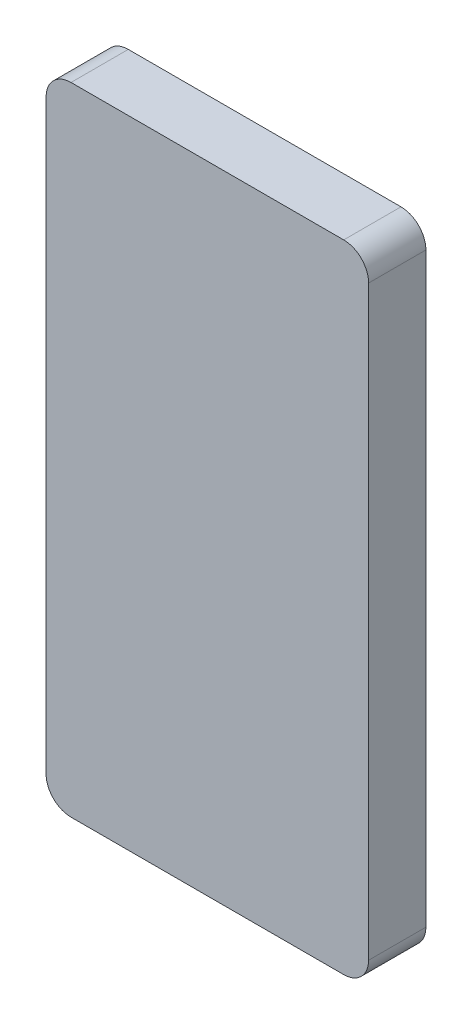
ISO-10303-21;
HEADER;
FILE_DESCRIPTION(('STEP AP214'),'2;1');
FILE_NAME('part.step','',(''),(''),'','','');
FILE_SCHEMA(('AUTOMOTIVE_DESIGN { 1 0 10303 214 1 1 1 1 }'));
ENDSEC;
DATA;
#1=APPLICATION_CONTEXT('core data for automotive mechanical design processes');
#2=APPLICATION_PROTOCOL_DEFINITION('international standard','automotive_design',2000,#1);
#3=PRODUCT_CONTEXT('',#1,'mechanical');
#4=PRODUCT('Part','Part','',(#3));
#5=PRODUCT_RELATED_PRODUCT_CATEGORY('part','',(#4));
#6=PRODUCT_DEFINITION_FORMATION('','',#4);
#7=PRODUCT_DEFINITION_CONTEXT('part definition',#1,'design');
#8=PRODUCT_DEFINITION('design','',#6,#7);
#9=PRODUCT_DEFINITION_SHAPE('','',#8);
#10=(LENGTH_UNIT() NAMED_UNIT(*) SI_UNIT(.MILLI.,.METRE.));
#11=(NAMED_UNIT(*) PLANE_ANGLE_UNIT() SI_UNIT($,.RADIAN.));
#12=(NAMED_UNIT(*) SI_UNIT($,.STERADIAN.) SOLID_ANGLE_UNIT());
#13=UNCERTAINTY_MEASURE_WITH_UNIT(LENGTH_MEASURE(1.E-05),#10,'distance_accuracy_value','');
#14=(GEOMETRIC_REPRESENTATION_CONTEXT(3) GLOBAL_UNCERTAINTY_ASSIGNED_CONTEXT((#13)) GLOBAL_UNIT_ASSIGNED_CONTEXT((#10,
#11,#12)) REPRESENTATION_CONTEXT('',''));
#15=CARTESIAN_POINT('',(0.,0.,0.));
#16=DIRECTION('',(0.,0.,1.));
#17=DIRECTION('',(1.,0.,0.));
#18=AXIS2_PLACEMENT_3D('',#15,#16,#17);
#19=CARTESIAN_POINT('',(32.893,-64.897,11.684));
#20=DIRECTION('',(-1.,0.,0.));
#21=DIRECTION('',(0.,0.,1.));
#22=AXIS2_PLACEMENT_3D('',#19,#20,#21);
#23=PLANE('',#22);
#24=DIRECTION('',(0.,1.,0.));
#25=VECTOR('',#24,1.);
#26=CARTESIAN_POINT('',(32.893,-64.897,11.684));
#27=LINE('',#26,#25);
#28=CARTESIAN_POINT('',(32.893,-59.817,11.684));
#29=VERTEX_POINT('',#28);
#30=CARTESIAN_POINT('',(32.893,59.817,11.684));
#31=VERTEX_POINT('',#30);
#32=EDGE_CURVE('E124',#29,#31,#27,.T.);
#33=ORIENTED_EDGE('',*,*,#32,.F.);
#34=DIRECTION('',(0.,0.,-1.));
#35=VECTOR('',#34,1.);
#36=CARTESIAN_POINT('',(32.893,-59.817,11.684));
#37=LINE('',#36,#35);
#38=CARTESIAN_POINT('',(32.893,-59.817,0.));
#39=VERTEX_POINT('',#38);
#40=EDGE_CURVE('E150',#29,#39,#37,.T.);
#41=ORIENTED_EDGE('',*,*,#40,.T.);
#42=DIRECTION('',(0.,1.,0.));
#43=VECTOR('',#42,1.);
#44=CARTESIAN_POINT('',(32.893,-64.897,0.));
#45=LINE('',#44,#43);
#46=CARTESIAN_POINT('',(32.893,59.817,0.));
#47=VERTEX_POINT('',#46);
#48=EDGE_CURVE('E158',#39,#47,#45,.T.);
#49=ORIENTED_EDGE('',*,*,#48,.T.);
#50=DIRECTION('',(0.,0.,-1.));
#51=VECTOR('',#50,1.);
#52=CARTESIAN_POINT('',(32.893,59.817,11.684));
#53=LINE('',#52,#51);
#54=EDGE_CURVE('E148',#47,#31,#53,.F.);
#55=ORIENTED_EDGE('',*,*,#54,.T.);
#56=EDGE_LOOP('',(#33,#41,#49,#55));
#57=FACE_BOUND('',#56,.T.);
#58=ADVANCED_FACE('F33',(#57),#23,.F.);
#59=CARTESIAN_POINT('',(-32.893,64.897,11.684));
#60=DIRECTION('',(0.,-1.,0.));
#61=DIRECTION('',(0.,0.,-1.));
#62=AXIS2_PLACEMENT_3D('',#59,#60,#61);
#63=PLANE('',#62);
#64=DIRECTION('',(-1.,0.,0.));
#65=VECTOR('',#64,1.);
#66=CARTESIAN_POINT('',(-32.893,64.897,0.));
#67=LINE('',#66,#65);
#68=CARTESIAN_POINT('',(27.813,64.897,0.));
#69=VERTEX_POINT('',#68);
#70=CARTESIAN_POINT('',(-27.813,64.897,0.));
#71=VERTEX_POINT('',#70);
#72=EDGE_CURVE('E129',#69,#71,#67,.T.);
#73=ORIENTED_EDGE('',*,*,#72,.T.);
#74=DIRECTION('',(0.,0.,-1.));
#75=VECTOR('',#74,1.);
#76=CARTESIAN_POINT('',(-27.813,64.897,11.684));
#77=LINE('',#76,#75);
#78=CARTESIAN_POINT('',(-27.813,64.897,11.684));
#79=VERTEX_POINT('',#78);
#80=EDGE_CURVE('E11',#71,#79,#77,.F.);
#81=ORIENTED_EDGE('',*,*,#80,.T.);
#82=DIRECTION('',(-1.,0.,0.));
#83=VECTOR('',#82,1.);
#84=CARTESIAN_POINT('',(-32.893,64.897,11.684));
#85=LINE('',#84,#83);
#86=CARTESIAN_POINT('',(27.813,64.897,11.684));
#87=VERTEX_POINT('',#86);
#88=EDGE_CURVE('E127',#87,#79,#85,.T.);
#89=ORIENTED_EDGE('',*,*,#88,.F.);
#90=DIRECTION('',(0.,0.,-1.));
#91=VECTOR('',#90,1.);
#92=CARTESIAN_POINT('',(27.813,64.897,11.684));
#93=LINE('',#92,#91);
#94=EDGE_CURVE('E41',#87,#69,#93,.T.);
#95=ORIENTED_EDGE('',*,*,#94,.T.);
#96=EDGE_LOOP('',(#73,#81,#89,#95));
#97=FACE_BOUND('',#96,.T.);
#98=ADVANCED_FACE('F155',(#97),#63,.F.);
#99=CARTESIAN_POINT('',(-32.893,-64.897,11.684));
#100=DIRECTION('',(1.,0.,0.));
#101=DIRECTION('',(0.,0.,-1.));
#102=AXIS2_PLACEMENT_3D('',#99,#100,#101);
#103=PLANE('',#102);
#104=DIRECTION('',(0.,-1.,0.));
#105=VECTOR('',#104,1.);
#106=CARTESIAN_POINT('',(-32.893,-64.897,0.));
#107=LINE('',#106,#105);
#108=CARTESIAN_POINT('',(-32.893,59.817,0.));
#109=VERTEX_POINT('',#108);
#110=CARTESIAN_POINT('',(-32.893,-59.817,0.));
#111=VERTEX_POINT('',#110);
#112=EDGE_CURVE('E125',#109,#111,#107,.T.);
#113=ORIENTED_EDGE('',*,*,#112,.T.);
#114=DIRECTION('',(0.,0.,-1.));
#115=VECTOR('',#114,1.);
#116=CARTESIAN_POINT('',(-32.893,-59.817,11.684));
#117=LINE('',#116,#115);
#118=CARTESIAN_POINT('',(-32.893,-59.817,11.684));
#119=VERTEX_POINT('',#118);
#120=EDGE_CURVE('E103',#111,#119,#117,.F.);
#121=ORIENTED_EDGE('',*,*,#120,.T.);
#122=DIRECTION('',(0.,-1.,0.));
#123=VECTOR('',#122,1.);
#124=CARTESIAN_POINT('',(-32.893,-64.897,11.684));
#125=LINE('',#124,#123);
#126=CARTESIAN_POINT('',(-32.893,59.817,11.684));
#127=VERTEX_POINT('',#126);
#128=EDGE_CURVE('E162',#127,#119,#125,.T.);
#129=ORIENTED_EDGE('',*,*,#128,.F.);
#130=DIRECTION('',(0.,0.,-1.));
#131=VECTOR('',#130,1.);
#132=CARTESIAN_POINT('',(-32.893,59.817,11.684));
#133=LINE('',#132,#131);
#134=EDGE_CURVE('E108',#127,#109,#133,.T.);
#135=ORIENTED_EDGE('',*,*,#134,.T.);
#136=EDGE_LOOP('',(#113,#121,#129,#135));
#137=FACE_BOUND('',#136,.T.);
#138=ADVANCED_FACE('F172',(#137),#103,.F.);
#139=CARTESIAN_POINT('',(-32.893,-64.897,11.684));
#140=DIRECTION('',(0.,1.,0.));
#141=DIRECTION('',(0.,0.,1.));
#142=AXIS2_PLACEMENT_3D('',#139,#140,#141);
#143=PLANE('',#142);
#144=DIRECTION('',(1.,0.,0.));
#145=VECTOR('',#144,1.);
#146=CARTESIAN_POINT('',(-32.893,-64.897,11.684));
#147=LINE('',#146,#145);
#148=CARTESIAN_POINT('',(-27.813,-64.897,11.684));
#149=VERTEX_POINT('',#148);
#150=CARTESIAN_POINT('',(27.813,-64.897,11.684));
#151=VERTEX_POINT('',#150);
#152=EDGE_CURVE('E118',#149,#151,#147,.T.);
#153=ORIENTED_EDGE('',*,*,#152,.F.);
#154=DIRECTION('',(0.,0.,-1.));
#155=VECTOR('',#154,1.);
#156=CARTESIAN_POINT('',(-27.813,-64.897,11.684));
#157=LINE('',#156,#155);
#158=CARTESIAN_POINT('',(-27.813,-64.897,0.));
#159=VERTEX_POINT('',#158);
#160=EDGE_CURVE('E102',#149,#159,#157,.T.);
#161=ORIENTED_EDGE('',*,*,#160,.T.);
#162=DIRECTION('',(1.,0.,0.));
#163=VECTOR('',#162,1.);
#164=CARTESIAN_POINT('',(-32.893,-64.897,0.));
#165=LINE('',#164,#163);
#166=CARTESIAN_POINT('',(27.813,-64.897,0.));
#167=VERTEX_POINT('',#166);
#168=EDGE_CURVE('E115',#159,#167,#165,.T.);
#169=ORIENTED_EDGE('',*,*,#168,.T.);
#170=DIRECTION('',(0.,0.,-1.));
#171=VECTOR('',#170,1.);
#172=CARTESIAN_POINT('',(27.813,-64.897,11.684));
#173=LINE('',#172,#171);
#174=EDGE_CURVE('E120',#167,#151,#173,.F.);
#175=ORIENTED_EDGE('',*,*,#174,.T.);
#176=EDGE_LOOP('',(#153,#161,#169,#175));
#177=FACE_BOUND('',#176,.T.);
#178=ADVANCED_FACE('F114',(#177),#143,.F.);
#179=CARTESIAN_POINT('',(0.,0.,11.684));
#180=DIRECTION('',(0.,0.,-1.));
#181=DIRECTION('',(-1.,0.,0.));
#182=AXIS2_PLACEMENT_3D('',#179,#180,#181);
#183=PLANE('',#182);
#184=ORIENTED_EDGE('',*,*,#128,.T.);
#185=CARTESIAN_POINT('',(-27.813,-59.817,11.684));
#186=DIRECTION('',(0.,0.,-1.));
#187=DIRECTION('',(-1.,0.,0.));
#188=AXIS2_PLACEMENT_3D('',#185,#186,#187);
#189=CIRCLE('',#188,5.08);
#190=EDGE_CURVE('E146',#119,#149,#189,.F.);
#191=ORIENTED_EDGE('',*,*,#190,.T.);
#192=ORIENTED_EDGE('',*,*,#152,.T.);
#193=CARTESIAN_POINT('',(27.813,-59.817,11.684));
#194=DIRECTION('',(0.,0.,-1.));
#195=DIRECTION('',(-1.,0.,0.));
#196=AXIS2_PLACEMENT_3D('',#193,#194,#195);
#197=CIRCLE('',#196,5.08);
#198=EDGE_CURVE('E144',#151,#29,#197,.F.);
#199=ORIENTED_EDGE('',*,*,#198,.T.);
#200=ORIENTED_EDGE('',*,*,#32,.T.);
#201=CARTESIAN_POINT('',(27.813,59.817,11.684));
#202=DIRECTION('',(0.,0.,-1.));
#203=DIRECTION('',(-1.,0.,0.));
#204=AXIS2_PLACEMENT_3D('',#201,#202,#203);
#205=CIRCLE('',#204,5.08);
#206=EDGE_CURVE('E53',#31,#87,#205,.F.);
#207=ORIENTED_EDGE('',*,*,#206,.T.);
#208=ORIENTED_EDGE('',*,*,#88,.T.);
#209=CARTESIAN_POINT('',(-27.813,59.817,11.684));
#210=DIRECTION('',(0.,0.,-1.));
#211=DIRECTION('',(-1.,0.,0.));
#212=AXIS2_PLACEMENT_3D('',#209,#210,#211);
#213=CIRCLE('',#212,5.08);
#214=EDGE_CURVE('E142',#79,#127,#213,.F.);
#215=ORIENTED_EDGE('',*,*,#214,.T.);
#216=EDGE_LOOP('',(#184,#191,#192,#199,#200,#207,#208,#215));
#217=FACE_BOUND('',#216,.T.);
#218=ADVANCED_FACE('F166',(#217),#183,.F.);
#219=CARTESIAN_POINT('',(0.,0.,0.));
#220=DIRECTION('',(0.,0.,-1.));
#221=DIRECTION('',(-1.,0.,0.));
#222=AXIS2_PLACEMENT_3D('',#219,#220,#221);
#223=PLANE('',#222);
#224=ORIENTED_EDGE('',*,*,#168,.F.);
#225=CARTESIAN_POINT('',(-27.813,-59.817,0.));
#226=DIRECTION('',(0.,0.,-1.));
#227=DIRECTION('',(-1.,0.,0.));
#228=AXIS2_PLACEMENT_3D('',#225,#226,#227);
#229=CIRCLE('',#228,5.08);
#230=EDGE_CURVE('E98',#159,#111,#229,.T.);
#231=ORIENTED_EDGE('',*,*,#230,.T.);
#232=ORIENTED_EDGE('',*,*,#112,.F.);
#233=CARTESIAN_POINT('',(-27.813,59.817,0.));
#234=DIRECTION('',(0.,0.,-1.));
#235=DIRECTION('',(-1.,0.,0.));
#236=AXIS2_PLACEMENT_3D('',#233,#234,#235);
#237=CIRCLE('',#236,5.08);
#238=EDGE_CURVE('E135',#109,#71,#237,.T.);
#239=ORIENTED_EDGE('',*,*,#238,.T.);
#240=ORIENTED_EDGE('',*,*,#72,.F.);
#241=CARTESIAN_POINT('',(27.813,59.817,0.));
#242=DIRECTION('',(0.,0.,-1.));
#243=DIRECTION('',(-1.,0.,0.));
#244=AXIS2_PLACEMENT_3D('',#241,#242,#243);
#245=CIRCLE('',#244,5.08);
#246=EDGE_CURVE('E119',#69,#47,#245,.T.);
#247=ORIENTED_EDGE('',*,*,#246,.T.);
#248=ORIENTED_EDGE('',*,*,#48,.F.);
#249=CARTESIAN_POINT('',(27.813,-59.817,0.));
#250=DIRECTION('',(0.,0.,-1.));
#251=DIRECTION('',(-1.,0.,0.));
#252=AXIS2_PLACEMENT_3D('',#249,#250,#251);
#253=CIRCLE('',#252,5.08);
#254=EDGE_CURVE('E109',#39,#167,#253,.T.);
#255=ORIENTED_EDGE('',*,*,#254,.T.);
#256=EDGE_LOOP('',(#224,#231,#232,#239,#240,#247,#248,#255));
#257=FACE_BOUND('',#256,.T.);
#258=ADVANCED_FACE('F122',(#257),#223,.T.);
#259=CARTESIAN_POINT('',(-27.813,-59.817,11.684));
#260=DIRECTION('',(0.,0.,-1.));
#261=DIRECTION('',(-1.,0.,0.));
#262=AXIS2_PLACEMENT_3D('',#259,#260,#261);
#263=CYLINDRICAL_SURFACE('',#262,5.08);
#264=ORIENTED_EDGE('',*,*,#190,.F.);
#265=ORIENTED_EDGE('',*,*,#120,.F.);
#266=ORIENTED_EDGE('',*,*,#230,.F.);
#267=ORIENTED_EDGE('',*,*,#160,.F.);
#268=EDGE_LOOP('',(#264,#265,#266,#267));
#269=FACE_BOUND('',#268,.T.);
#270=ADVANCED_FACE('F101',(#269),#263,.T.);
#271=CARTESIAN_POINT('',(27.813,-59.817,11.684));
#272=DIRECTION('',(0.,0.,-1.));
#273=DIRECTION('',(-1.,0.,0.));
#274=AXIS2_PLACEMENT_3D('',#271,#272,#273);
#275=CYLINDRICAL_SURFACE('',#274,5.08);
#276=ORIENTED_EDGE('',*,*,#198,.F.);
#277=ORIENTED_EDGE('',*,*,#174,.F.);
#278=ORIENTED_EDGE('',*,*,#254,.F.);
#279=ORIENTED_EDGE('',*,*,#40,.F.);
#280=EDGE_LOOP('',(#276,#277,#278,#279));
#281=FACE_BOUND('',#280,.T.);
#282=ADVANCED_FACE('F177',(#281),#275,.T.);
#283=CARTESIAN_POINT('',(-27.813,59.817,11.684));
#284=DIRECTION('',(0.,0.,-1.));
#285=DIRECTION('',(-1.,0.,0.));
#286=AXIS2_PLACEMENT_3D('',#283,#284,#285);
#287=CYLINDRICAL_SURFACE('',#286,5.08);
#288=ORIENTED_EDGE('',*,*,#214,.F.);
#289=ORIENTED_EDGE('',*,*,#80,.F.);
#290=ORIENTED_EDGE('',*,*,#238,.F.);
#291=ORIENTED_EDGE('',*,*,#134,.F.);
#292=EDGE_LOOP('',(#288,#289,#290,#291));
#293=FACE_BOUND('',#292,.T.);
#294=ADVANCED_FACE('F170',(#293),#287,.T.);
#295=CARTESIAN_POINT('',(27.813,59.817,11.684));
#296=DIRECTION('',(0.,0.,-1.));
#297=DIRECTION('',(-1.,0.,0.));
#298=AXIS2_PLACEMENT_3D('',#295,#296,#297);
#299=CYLINDRICAL_SURFACE('',#298,5.08);
#300=ORIENTED_EDGE('',*,*,#206,.F.);
#301=ORIENTED_EDGE('',*,*,#54,.F.);
#302=ORIENTED_EDGE('',*,*,#246,.F.);
#303=ORIENTED_EDGE('',*,*,#94,.F.);
#304=EDGE_LOOP('',(#300,#301,#302,#303));
#305=FACE_BOUND('',#304,.T.);
#306=ADVANCED_FACE('F35',(#305),#299,.T.);
#307=CLOSED_SHELL('',(#58,#98,#138,#178,#218,#258,#270,#282,#294,#306));
#308=MANIFOLD_SOLID_BREP('B2',#307);
#309=ADVANCED_BREP_SHAPE_REPRESENTATION('',(#18,#308),#14);
#310=SHAPE_DEFINITION_REPRESENTATION(#9,#309);
ENDSEC;
END-ISO-10303-21;
